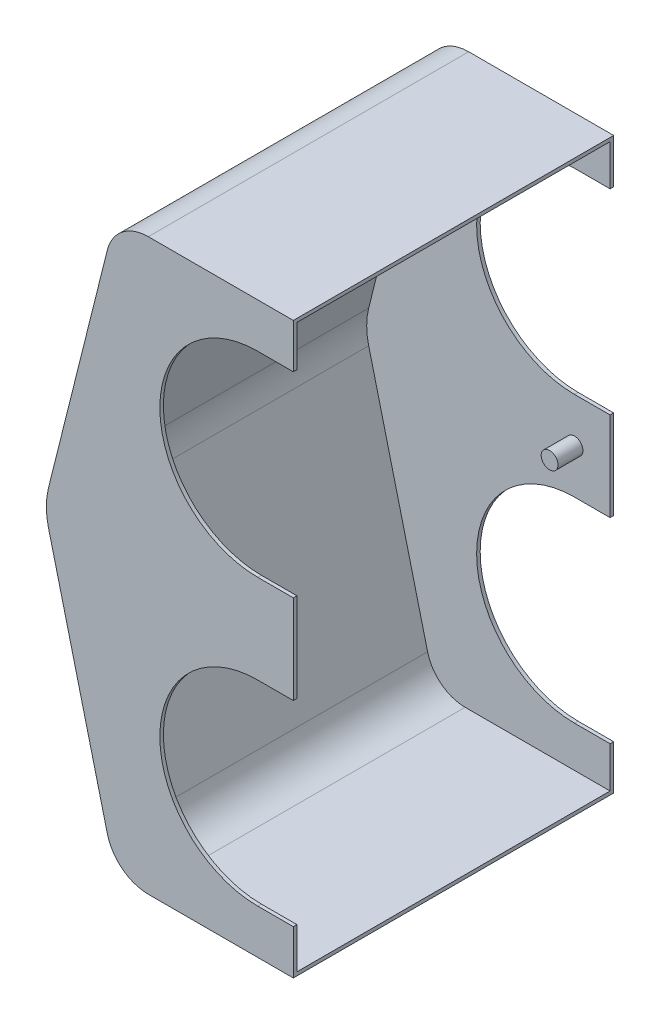
ISO-10303-21;
HEADER;
FILE_DESCRIPTION(('STEP AP214'),'2;1');
FILE_NAME('part.step','',(''),(''),'','','');
FILE_SCHEMA(('AUTOMOTIVE_DESIGN { 1 0 10303 214 1 1 1 1 }'));
ENDSEC;
DATA;
#1=APPLICATION_CONTEXT('core data for automotive mechanical design processes');
#2=APPLICATION_PROTOCOL_DEFINITION('international standard','automotive_design',2000,#1);
#3=PRODUCT_CONTEXT('',#1,'mechanical');
#4=PRODUCT('Part','Part','',(#3));
#5=PRODUCT_RELATED_PRODUCT_CATEGORY('part','',(#4));
#6=PRODUCT_DEFINITION_FORMATION('','',#4);
#7=PRODUCT_DEFINITION_CONTEXT('part definition',#1,'design');
#8=PRODUCT_DEFINITION('design','',#6,#7);
#9=PRODUCT_DEFINITION_SHAPE('','',#8);
#10=(LENGTH_UNIT() NAMED_UNIT(*) SI_UNIT(.MILLI.,.METRE.));
#11=(NAMED_UNIT(*) PLANE_ANGLE_UNIT() SI_UNIT($,.RADIAN.));
#12=(NAMED_UNIT(*) SI_UNIT($,.STERADIAN.) SOLID_ANGLE_UNIT());
#13=UNCERTAINTY_MEASURE_WITH_UNIT(LENGTH_MEASURE(1.E-05),#10,'distance_accuracy_value','');
#14=(GEOMETRIC_REPRESENTATION_CONTEXT(3) GLOBAL_UNCERTAINTY_ASSIGNED_CONTEXT((#13)) GLOBAL_UNIT_ASSIGNED_CONTEXT((#10,
#11,#12)) REPRESENTATION_CONTEXT('',''));
#15=CARTESIAN_POINT('',(0.,0.,0.));
#16=DIRECTION('',(0.,0.,1.));
#17=DIRECTION('',(1.,0.,0.));
#18=AXIS2_PLACEMENT_3D('',#15,#16,#17);
#19=CARTESIAN_POINT('',(0.,0.,0.));
#20=DIRECTION('',(1.,0.,0.));
#21=DIRECTION('',(0.,0.,-1.));
#22=AXIS2_PLACEMENT_3D('',#19,#20,#21);
#23=PLANE('',#22);
#24=DIRECTION('',(0.,-1.,0.));
#25=VECTOR('',#24,1.);
#26=CARTESIAN_POINT('',(0.,0.,-1.27));
#27=LINE('',#26,#25);
#28=CARTESIAN_POINT('',(0.,-85.725,-1.27000000000001));
#29=VERTEX_POINT('',#28);
#30=CARTESIAN_POINT('',(0.,-117.475,-1.27000000000001));
#31=VERTEX_POINT('',#30);
#32=EDGE_CURVE('E290',#29,#31,#27,.T.);
#33=ORIENTED_EDGE('',*,*,#32,.F.);
#34=DIRECTION('',(0.,0.,1.));
#35=VECTOR('',#34,1.);
#36=CARTESIAN_POINT('',(0.,-85.725,-114.3));
#37=LINE('',#36,#35);
#38=CARTESIAN_POINT('',(0.,-85.725,0.));
#39=VERTEX_POINT('',#38);
#40=EDGE_CURVE('E359',#29,#39,#37,.T.);
#41=ORIENTED_EDGE('',*,*,#40,.T.);
#42=DIRECTION('',(0.,-1.,0.));
#43=VECTOR('',#42,1.);
#44=CARTESIAN_POINT('',(0.,0.,0.));
#45=LINE('',#44,#43);
#46=CARTESIAN_POINT('',(0.,-117.475,0.));
#47=VERTEX_POINT('',#46);
#48=EDGE_CURVE('E411',#39,#47,#45,.T.);
#49=ORIENTED_EDGE('',*,*,#48,.T.);
#50=DIRECTION('',(0.,0.,1.));
#51=VECTOR('',#50,1.);
#52=CARTESIAN_POINT('',(0.,-117.475,-114.3));
#53=LINE('',#52,#51);
#54=EDGE_CURVE('E389',#31,#47,#53,.T.);
#55=ORIENTED_EDGE('',*,*,#54,.F.);
#56=EDGE_LOOP('',(#33,#41,#49,#55));
#57=FACE_BOUND('',#56,.T.);
#58=ADVANCED_FACE('F38',(#57),#23,.T.);
#59=CARTESIAN_POINT('',(-12.7,-152.4,-114.3));
#60=DIRECTION('',(0.,0.,1.));
#61=DIRECTION('',(1.,0.,0.));
#62=AXIS2_PLACEMENT_3D('',#59,#60,#61);
#63=CYLINDRICAL_SURFACE('',#62,34.925);
#64=CARTESIAN_POINT('',(-12.7,-152.4,-1.27000000000002));
#65=DIRECTION('',(0.,0.,1.));
#66=DIRECTION('',(0.,-1.,0.));
#67=AXIS2_PLACEMENT_3D('',#64,#65,#66);
#68=CIRCLE('',#67,34.925);
#69=CARTESIAN_POINT('',(-12.7,-117.475,-1.27000000000001));
#70=VERTEX_POINT('',#69);
#71=CARTESIAN_POINT('',(-12.7,-187.325,-1.27000000000002));
#72=VERTEX_POINT('',#71);
#73=EDGE_CURVE('E297',#70,#72,#68,.T.);
#74=ORIENTED_EDGE('',*,*,#73,.F.);
#75=DIRECTION('',(0.,0.,1.));
#76=VECTOR('',#75,1.);
#77=CARTESIAN_POINT('',(-12.7,-117.475,-114.3));
#78=LINE('',#77,#76);
#79=CARTESIAN_POINT('',(-12.7,-117.475,0.));
#80=VERTEX_POINT('',#79);
#81=EDGE_CURVE('E385',#70,#80,#78,.T.);
#82=ORIENTED_EDGE('',*,*,#81,.T.);
#83=CARTESIAN_POINT('',(-12.7,-152.4,0.));
#84=DIRECTION('',(0.,0.,1.));
#85=DIRECTION('',(1.,0.,0.));
#86=AXIS2_PLACEMENT_3D('',#83,#84,#85);
#87=CIRCLE('',#86,34.925);
#88=CARTESIAN_POINT('',(-12.7,-187.325,0.));
#89=VERTEX_POINT('',#88);
#90=EDGE_CURVE('E352',#80,#89,#87,.T.);
#91=ORIENTED_EDGE('',*,*,#90,.T.);
#92=DIRECTION('',(0.,0.,1.));
#93=VECTOR('',#92,1.);
#94=CARTESIAN_POINT('',(-12.7,-187.325,-114.3));
#95=LINE('',#94,#93);
#96=EDGE_CURVE('E373',#72,#89,#95,.T.);
#97=ORIENTED_EDGE('',*,*,#96,.F.);
#98=EDGE_LOOP('',(#74,#82,#91,#97));
#99=FACE_BOUND('',#98,.T.);
#100=ADVANCED_FACE('F503',(#99),#63,.F.);
#101=CARTESIAN_POINT('',(-12.7,-117.475,-114.3));
#102=DIRECTION('',(0.,1.,0.));
#103=DIRECTION('',(0.,0.,1.));
#104=AXIS2_PLACEMENT_3D('',#101,#102,#103);
#105=PLANE('',#104);
#106=DIRECTION('',(-1.,0.,0.));
#107=VECTOR('',#106,1.);
#108=CARTESIAN_POINT('',(-88.9,-117.475,-1.27000000000002));
#109=LINE('',#108,#107);
#110=EDGE_CURVE('E293',#31,#70,#109,.T.);
#111=ORIENTED_EDGE('',*,*,#110,.F.);
#112=ORIENTED_EDGE('',*,*,#54,.T.);
#113=DIRECTION('',(-1.,0.,0.));
#114=VECTOR('',#113,1.);
#115=CARTESIAN_POINT('',(-12.7,-117.475,0.));
#116=LINE('',#115,#114);
#117=EDGE_CURVE('E367',#47,#80,#116,.T.);
#118=ORIENTED_EDGE('',*,*,#117,.T.);
#119=ORIENTED_EDGE('',*,*,#81,.F.);
#120=EDGE_LOOP('',(#111,#112,#118,#119));
#121=FACE_BOUND('',#120,.T.);
#122=ADVANCED_FACE('F498',(#121),#105,.F.);
#123=CARTESIAN_POINT('',(-12.7,-187.325,-114.3));
#124=DIRECTION('',(0.,-1.,0.));
#125=DIRECTION('',(0.,0.,-1.));
#126=AXIS2_PLACEMENT_3D('',#123,#124,#125);
#127=PLANE('',#126);
#128=DIRECTION('',(1.,0.,0.));
#129=VECTOR('',#128,1.);
#130=CARTESIAN_POINT('',(-88.9,-187.325,-1.27000000000003));
#131=LINE('',#130,#129);
#132=CARTESIAN_POINT('',(0.,-187.325,-1.27000000000002));
#133=VERTEX_POINT('',#132);
#134=EDGE_CURVE('E296',#72,#133,#131,.T.);
#135=ORIENTED_EDGE('',*,*,#134,.F.);
#136=ORIENTED_EDGE('',*,*,#96,.T.);
#137=DIRECTION('',(1.,0.,0.));
#138=VECTOR('',#137,1.);
#139=CARTESIAN_POINT('',(-12.7,-187.325,0.));
#140=LINE('',#139,#138);
#141=CARTESIAN_POINT('',(0.,-187.325,0.));
#142=VERTEX_POINT('',#141);
#143=EDGE_CURVE('E376',#89,#142,#140,.T.);
#144=ORIENTED_EDGE('',*,*,#143,.T.);
#145=DIRECTION('',(0.,0.,1.));
#146=VECTOR('',#145,1.);
#147=CARTESIAN_POINT('',(0.,-187.325,-114.3));
#148=LINE('',#147,#146);
#149=EDGE_CURVE('E393',#133,#142,#148,.T.);
#150=ORIENTED_EDGE('',*,*,#149,.F.);
#151=EDGE_LOOP('',(#135,#136,#144,#150));
#152=FACE_BOUND('',#151,.T.);
#153=ADVANCED_FACE('F505',(#152),#127,.F.);
#154=CARTESIAN_POINT('',(-12.7,-50.8,-114.3));
#155=DIRECTION('',(0.,0.,1.));
#156=DIRECTION('',(1.,0.,0.));
#157=AXIS2_PLACEMENT_3D('',#154,#155,#156);
#158=CYLINDRICAL_SURFACE('',#157,34.925);
#159=CARTESIAN_POINT('',(-12.7,-50.8,-1.27000000000001));
#160=DIRECTION('',(0.,0.,1.));
#161=DIRECTION('',(0.,-1.,0.));
#162=AXIS2_PLACEMENT_3D('',#159,#160,#161);
#163=CIRCLE('',#162,34.925);
#164=CARTESIAN_POINT('',(-12.7,-15.875,-1.26999999999999));
#165=VERTEX_POINT('',#164);
#166=CARTESIAN_POINT('',(-12.7,-85.725,-1.27000000000001));
#167=VERTEX_POINT('',#166);
#168=EDGE_CURVE('E286',#165,#167,#163,.T.);
#169=ORIENTED_EDGE('',*,*,#168,.F.);
#170=DIRECTION('',(0.,0.,1.));
#171=VECTOR('',#170,1.);
#172=CARTESIAN_POINT('',(-12.7,-15.875,-114.3));
#173=LINE('',#172,#171);
#174=CARTESIAN_POINT('',(-12.7,-15.875,0.));
#175=VERTEX_POINT('',#174);
#176=EDGE_CURVE('E353',#165,#175,#173,.T.);
#177=ORIENTED_EDGE('',*,*,#176,.T.);
#178=CARTESIAN_POINT('',(-12.7,-50.8,0.));
#179=DIRECTION('',(0.,0.,1.));
#180=DIRECTION('',(1.,0.,0.));
#181=AXIS2_PLACEMENT_3D('',#178,#179,#180);
#182=CIRCLE('',#181,34.925);
#183=CARTESIAN_POINT('',(-12.7,-85.725,0.));
#184=VERTEX_POINT('',#183);
#185=EDGE_CURVE('E340',#175,#184,#182,.T.);
#186=ORIENTED_EDGE('',*,*,#185,.T.);
#187=DIRECTION('',(0.,0.,1.));
#188=VECTOR('',#187,1.);
#189=CARTESIAN_POINT('',(-12.7,-85.725,-114.3));
#190=LINE('',#189,#188);
#191=EDGE_CURVE('E339',#167,#184,#190,.T.);
#192=ORIENTED_EDGE('',*,*,#191,.F.);
#193=EDGE_LOOP('',(#169,#177,#186,#192));
#194=FACE_BOUND('',#193,.T.);
#195=ADVANCED_FACE('F618',(#194),#158,.F.);
#196=CARTESIAN_POINT('',(-12.7,-15.875,-114.3));
#197=DIRECTION('',(0.,1.,0.));
#198=DIRECTION('',(0.,0.,1.));
#199=AXIS2_PLACEMENT_3D('',#196,#197,#198);
#200=PLANE('',#199);
#201=DIRECTION('',(-1.,0.,0.));
#202=VECTOR('',#201,1.);
#203=CARTESIAN_POINT('',(-88.9,-15.875,-1.27));
#204=LINE('',#203,#202);
#205=CARTESIAN_POINT('',(0.,-15.875,-1.26999999999999));
#206=VERTEX_POINT('',#205);
#207=EDGE_CURVE('E282',#206,#165,#204,.T.);
#208=ORIENTED_EDGE('',*,*,#207,.F.);
#209=DIRECTION('',(0.,0.,1.));
#210=VECTOR('',#209,1.);
#211=CARTESIAN_POINT('',(0.,-15.875,-114.3));
#212=LINE('',#211,#210);
#213=CARTESIAN_POINT('',(0.,-15.875,0.));
#214=VERTEX_POINT('',#213);
#215=EDGE_CURVE('E357',#206,#214,#212,.T.);
#216=ORIENTED_EDGE('',*,*,#215,.T.);
#217=DIRECTION('',(-1.,0.,0.));
#218=VECTOR('',#217,1.);
#219=CARTESIAN_POINT('',(-12.7,-15.875,0.));
#220=LINE('',#219,#218);
#221=EDGE_CURVE('E334',#214,#175,#220,.T.);
#222=ORIENTED_EDGE('',*,*,#221,.T.);
#223=ORIENTED_EDGE('',*,*,#176,.F.);
#224=EDGE_LOOP('',(#208,#216,#222,#223));
#225=FACE_BOUND('',#224,.T.);
#226=ADVANCED_FACE('F612',(#225),#200,.F.);
#227=CARTESIAN_POINT('',(-12.7,-85.725,-114.3));
#228=DIRECTION('',(0.,-1.,0.));
#229=DIRECTION('',(0.,0.,-1.));
#230=AXIS2_PLACEMENT_3D('',#227,#228,#229);
#231=PLANE('',#230);
#232=DIRECTION('',(1.,0.,0.));
#233=VECTOR('',#232,1.);
#234=CARTESIAN_POINT('',(-88.9,-85.725,-1.27000000000001));
#235=LINE('',#234,#233);
#236=EDGE_CURVE('E285',#167,#29,#235,.T.);
#237=ORIENTED_EDGE('',*,*,#236,.F.);
#238=ORIENTED_EDGE('',*,*,#191,.T.);
#239=DIRECTION('',(1.,0.,0.));
#240=VECTOR('',#239,1.);
#241=CARTESIAN_POINT('',(-12.7,-85.725,0.));
#242=LINE('',#241,#240);
#243=EDGE_CURVE('E343',#184,#39,#242,.T.);
#244=ORIENTED_EDGE('',*,*,#243,.T.);
#245=ORIENTED_EDGE('',*,*,#40,.F.);
#246=EDGE_LOOP('',(#237,#238,#244,#245));
#247=FACE_BOUND('',#246,.T.);
#248=ADVANCED_FACE('F572',(#247),#231,.F.);
#249=DIRECTION('',(0.,1.,0.));
#250=VECTOR('',#249,1.);
#251=CARTESIAN_POINT('',(0.,0.,-113.03));
#252=LINE('',#251,#250);
#253=CARTESIAN_POINT('',(0.,-15.875,-113.03));
#254=VERTEX_POINT('',#253);
#255=CARTESIAN_POINT('',(0.,-1.27,-113.03));
#256=VERTEX_POINT('',#255);
#257=EDGE_CURVE('E305',#254,#256,#252,.T.);
#258=ORIENTED_EDGE('',*,*,#257,.F.);
#259=CARTESIAN_POINT('',(0.,-15.875,-114.3));
#260=VERTEX_POINT('',#259);
#261=EDGE_CURVE('E354',#260,#254,#212,.T.);
#262=ORIENTED_EDGE('',*,*,#261,.F.);
#263=DIRECTION('',(0.,1.,0.));
#264=VECTOR('',#263,1.);
#265=CARTESIAN_POINT('',(0.,0.,-114.3));
#266=LINE('',#265,#264);
#267=CARTESIAN_POINT('',(0.,0.,-114.3));
#268=VERTEX_POINT('',#267);
#269=EDGE_CURVE('E414',#260,#268,#266,.T.);
#270=ORIENTED_EDGE('',*,*,#269,.T.);
#271=DIRECTION('',(0.,0.,1.));
#272=VECTOR('',#271,1.);
#273=CARTESIAN_POINT('',(0.,0.,0.));
#274=LINE('',#273,#272);
#275=CARTESIAN_POINT('',(0.,0.,0.));
#276=VERTEX_POINT('',#275);
#277=EDGE_CURVE('E418',#268,#276,#274,.T.);
#278=ORIENTED_EDGE('',*,*,#277,.T.);
#279=EDGE_CURVE('E407',#276,#214,#45,.T.);
#280=ORIENTED_EDGE('',*,*,#279,.T.);
#281=ORIENTED_EDGE('',*,*,#215,.F.);
#282=DIRECTION('',(0.,-1.,0.));
#283=VECTOR('',#282,1.);
#284=CARTESIAN_POINT('',(0.,0.,-1.27));
#285=LINE('',#284,#283);
#286=CARTESIAN_POINT('',(0.,-1.27,-1.27));
#287=VERTEX_POINT('',#286);
#288=EDGE_CURVE('E292',#287,#206,#285,.T.);
#289=ORIENTED_EDGE('',*,*,#288,.F.);
#290=DIRECTION('',(0.,0.,1.));
#291=VECTOR('',#290,1.);
#292=CARTESIAN_POINT('',(0.,-1.27,0.));
#293=LINE('',#292,#291);
#294=EDGE_CURVE('E308',#256,#287,#293,.T.);
#295=ORIENTED_EDGE('',*,*,#294,.F.);
#296=EDGE_LOOP('',(#258,#262,#270,#278,#280,#281,#289,#295));
#297=FACE_BOUND('',#296,.T.);
#298=ADVANCED_FACE('F562',(#297),#23,.T.);
#299=DIRECTION('',(0.,1.,0.));
#300=VECTOR('',#299,1.);
#301=CARTESIAN_POINT('',(0.,0.,-113.03));
#302=LINE('',#301,#300);
#303=CARTESIAN_POINT('',(0.,-117.475,-113.03));
#304=VERTEX_POINT('',#303);
#305=CARTESIAN_POINT('',(0.,-85.725,-113.03));
#306=VERTEX_POINT('',#305);
#307=EDGE_CURVE('E53',#304,#306,#302,.T.);
#308=ORIENTED_EDGE('',*,*,#307,.F.);
#309=CARTESIAN_POINT('',(0.,-117.475,-114.3));
#310=VERTEX_POINT('',#309);
#311=EDGE_CURVE('E386',#310,#304,#53,.T.);
#312=ORIENTED_EDGE('',*,*,#311,.F.);
#313=CARTESIAN_POINT('',(0.,-85.725,-114.3));
#314=VERTEX_POINT('',#313);
#315=EDGE_CURVE('E419',#310,#314,#266,.T.);
#316=ORIENTED_EDGE('',*,*,#315,.T.);
#317=EDGE_CURVE('E60',#314,#306,#37,.T.);
#318=ORIENTED_EDGE('',*,*,#317,.T.);
#319=EDGE_LOOP('',(#308,#312,#316,#318));
#320=FACE_BOUND('',#319,.T.);
#321=ADVANCED_FACE('F571',(#320),#23,.T.);
#322=CARTESIAN_POINT('',(-88.9,0.,0.));
#323=DIRECTION('',(0.,0.,1.));
#324=DIRECTION('',(0.,-1.,0.));
#325=AXIS2_PLACEMENT_3D('',#322,#323,#324);
#326=PLANE('',#325);
#327=ORIENTED_EDGE('',*,*,#221,.F.);
#328=ORIENTED_EDGE('',*,*,#279,.F.);
#329=DIRECTION('',(1.,0.,0.));
#330=VECTOR('',#329,1.);
#331=CARTESIAN_POINT('',(-88.9,0.,0.));
#332=LINE('',#331,#330);
#333=CARTESIAN_POINT('',(-51.7258917914214,0.,0.));
#334=VERTEX_POINT('',#333);
#335=EDGE_CURVE('E423',#334,#276,#332,.T.);
#336=ORIENTED_EDGE('',*,*,#335,.F.);
#337=CARTESIAN_POINT('',(-51.7258917914214,-15.08,0.));
#338=DIRECTION('',(0.,0.,1.));
#339=DIRECTION('',(0.,-1.,0.));
#340=AXIS2_PLACEMENT_3D('',#337,#338,#339);
#341=CIRCLE('',#340,15.08);
#342=CARTESIAN_POINT('',(-66.355640693613,-11.4225627744521,0.));
#343=VERTEX_POINT('',#342);
#344=EDGE_CURVE('E454',#334,#343,#341,.T.);
#345=ORIENTED_EDGE('',*,*,#344,.T.);
#346=DIRECTION('',(-0.242535625036333,-0.970142500145332,0.));
#347=VECTOR('',#346,1.);
#348=CARTESIAN_POINT('',(-59.7647058823529,14.9411764705882,0.));
#349=LINE('',#348,#347);
#350=CARTESIAN_POINT('',(-87.3696002060207,-95.4784008240831,0.));
#351=VERTEX_POINT('',#350);
#352=EDGE_CURVE('E403',#343,#351,#349,.T.);
#353=ORIENTED_EDGE('',*,*,#352,.T.);
#354=CARTESIAN_POINT('',(-62.8832035023526,-101.6,0.));
#355=DIRECTION('',(0.,0.,1.));
#356=DIRECTION('',(0.,-1.,0.));
#357=AXIS2_PLACEMENT_3D('',#354,#355,#356);
#358=CIRCLE('',#357,25.24);
#359=CARTESIAN_POINT('',(-87.3696002060207,-107.721599175917,0.));
#360=VERTEX_POINT('',#359);
#361=EDGE_CURVE('E441',#351,#360,#358,.T.);
#362=ORIENTED_EDGE('',*,*,#361,.T.);
#363=DIRECTION('',(0.242535625036333,-0.970142500145332,0.));
#364=VECTOR('',#363,1.);
#365=CARTESIAN_POINT('',(-107.576470588235,-26.8941176470588,0.));
#366=LINE('',#365,#364);
#367=CARTESIAN_POINT('',(-66.355640693613,-191.777437225548,0.));
#368=VERTEX_POINT('',#367);
#369=EDGE_CURVE('E397',#360,#368,#366,.T.);
#370=ORIENTED_EDGE('',*,*,#369,.T.);
#371=CARTESIAN_POINT('',(-51.7258917914214,-188.12,0.));
#372=DIRECTION('',(0.,0.,1.));
#373=DIRECTION('',(0.,-1.,0.));
#374=AXIS2_PLACEMENT_3D('',#371,#372,#373);
#375=CIRCLE('',#374,15.08);
#376=CARTESIAN_POINT('',(-51.7258917914214,-203.2,0.));
#377=VERTEX_POINT('',#376);
#378=EDGE_CURVE('E452',#368,#377,#375,.T.);
#379=ORIENTED_EDGE('',*,*,#378,.T.);
#380=DIRECTION('',(1.,0.,0.));
#381=VECTOR('',#380,1.);
#382=CARTESIAN_POINT('',(-88.9,-203.2,0.));
#383=LINE('',#382,#381);
#384=CARTESIAN_POINT('',(0.,-203.2,0.));
#385=VERTEX_POINT('',#384);
#386=EDGE_CURVE('E422',#377,#385,#383,.T.);
#387=ORIENTED_EDGE('',*,*,#386,.T.);
#388=EDGE_CURVE('E405',#142,#385,#45,.T.);
#389=ORIENTED_EDGE('',*,*,#388,.F.);
#390=ORIENTED_EDGE('',*,*,#143,.F.);
#391=ORIENTED_EDGE('',*,*,#90,.F.);
#392=ORIENTED_EDGE('',*,*,#117,.F.);
#393=ORIENTED_EDGE('',*,*,#48,.F.);
#394=ORIENTED_EDGE('',*,*,#243,.F.);
#395=ORIENTED_EDGE('',*,*,#185,.F.);
#396=EDGE_LOOP('',(#327,#328,#336,#345,#353,#362,#370,#379,#387,#389,#390,#391,#392,#393,#394,#395));
#397=FACE_BOUND('',#396,.T.);
#398=ADVANCED_FACE('F468',(#397),#326,.T.);
#399=CARTESIAN_POINT('',(-88.9,0.,0.));
#400=DIRECTION('',(0.,1.,0.));
#401=DIRECTION('',(0.,0.,1.));
#402=AXIS2_PLACEMENT_3D('',#399,#400,#401);
#403=PLANE('',#402);
#404=DIRECTION('',(1.,0.,0.));
#405=VECTOR('',#404,1.);
#406=CARTESIAN_POINT('',(-88.9,0.,-114.3));
#407=LINE('',#406,#405);
#408=CARTESIAN_POINT('',(-51.7258917914214,0.,-114.3));
#409=VERTEX_POINT('',#408);
#410=EDGE_CURVE('E426',#409,#268,#407,.T.);
#411=ORIENTED_EDGE('',*,*,#410,.F.);
#412=DIRECTION('',(0.,0.,-1.));
#413=VECTOR('',#412,1.);
#414=CARTESIAN_POINT('',(-51.7258917914214,0.,0.));
#415=LINE('',#414,#413);
#416=EDGE_CURVE('E450',#409,#334,#415,.F.);
#417=ORIENTED_EDGE('',*,*,#416,.T.);
#418=ORIENTED_EDGE('',*,*,#335,.T.);
#419=ORIENTED_EDGE('',*,*,#277,.F.);
#420=EDGE_LOOP('',(#411,#417,#418,#419));
#421=FACE_BOUND('',#420,.T.);
#422=ADVANCED_FACE('F587',(#421),#403,.T.);
#423=CARTESIAN_POINT('',(-88.9,0.,-114.3));
#424=DIRECTION('',(0.,0.,-1.));
#425=DIRECTION('',(0.,1.,0.));
#426=AXIS2_PLACEMENT_3D('',#423,#424,#425);
#427=PLANE('',#426);
#428=DIRECTION('',(-1.,0.,0.));
#429=VECTOR('',#428,1.);
#430=CARTESIAN_POINT('',(-12.7,-15.875,-114.3));
#431=LINE('',#430,#429);
#432=CARTESIAN_POINT('',(-12.7,-15.875,-114.3));
#433=VERTEX_POINT('',#432);
#434=EDGE_CURVE('E336',#260,#433,#431,.T.);
#435=ORIENTED_EDGE('',*,*,#434,.T.);
#436=CARTESIAN_POINT('',(-12.7,-50.8,-114.3));
#437=DIRECTION('',(0.,0.,1.));
#438=DIRECTION('',(1.,0.,0.));
#439=AXIS2_PLACEMENT_3D('',#436,#437,#438);
#440=CIRCLE('',#439,34.925);
#441=CARTESIAN_POINT('',(-12.7,-85.725,-114.3));
#442=VERTEX_POINT('',#441);
#443=EDGE_CURVE('E330',#433,#442,#440,.T.);
#444=ORIENTED_EDGE('',*,*,#443,.T.);
#445=DIRECTION('',(1.,0.,0.));
#446=VECTOR('',#445,1.);
#447=CARTESIAN_POINT('',(-12.7,-85.725,-114.3));
#448=LINE('',#447,#446);
#449=EDGE_CURVE('E333',#442,#314,#448,.T.);
#450=ORIENTED_EDGE('',*,*,#449,.T.);
#451=ORIENTED_EDGE('',*,*,#315,.F.);
#452=DIRECTION('',(-1.,0.,0.));
#453=VECTOR('',#452,1.);
#454=CARTESIAN_POINT('',(-12.7,-117.475,-114.3));
#455=LINE('',#454,#453);
#456=CARTESIAN_POINT('',(-12.7,-117.475,-114.3));
#457=VERTEX_POINT('',#456);
#458=EDGE_CURVE('E370',#310,#457,#455,.T.);
#459=ORIENTED_EDGE('',*,*,#458,.T.);
#460=CARTESIAN_POINT('',(-12.7,-152.4,-114.3));
#461=DIRECTION('',(0.,0.,1.));
#462=DIRECTION('',(1.,0.,0.));
#463=AXIS2_PLACEMENT_3D('',#460,#461,#462);
#464=CIRCLE('',#463,34.925);
#465=CARTESIAN_POINT('',(-12.7,-187.325,-114.3));
#466=VERTEX_POINT('',#465);
#467=EDGE_CURVE('E363',#457,#466,#464,.T.);
#468=ORIENTED_EDGE('',*,*,#467,.T.);
#469=DIRECTION('',(1.,0.,0.));
#470=VECTOR('',#469,1.);
#471=CARTESIAN_POINT('',(-12.7,-187.325,-114.3));
#472=LINE('',#471,#470);
#473=CARTESIAN_POINT('',(0.,-187.325,-114.3));
#474=VERTEX_POINT('',#473);
#475=EDGE_CURVE('E366',#466,#474,#472,.T.);
#476=ORIENTED_EDGE('',*,*,#475,.T.);
#477=CARTESIAN_POINT('',(0.,-203.2,-114.3));
#478=VERTEX_POINT('',#477);
#479=EDGE_CURVE('E415',#478,#474,#266,.T.);
#480=ORIENTED_EDGE('',*,*,#479,.F.);
#481=DIRECTION('',(1.,0.,0.));
#482=VECTOR('',#481,1.);
#483=CARTESIAN_POINT('',(-88.9,-203.2,-114.3));
#484=LINE('',#483,#482);
#485=CARTESIAN_POINT('',(-51.7258917914214,-203.2,-114.3));
#486=VERTEX_POINT('',#485);
#487=EDGE_CURVE('E429',#486,#478,#484,.T.);
#488=ORIENTED_EDGE('',*,*,#487,.F.);
#489=CARTESIAN_POINT('',(-51.7258917914214,-188.12,-114.3));
#490=DIRECTION('',(0.,0.,-1.));
#491=DIRECTION('',(0.,1.,0.));
#492=AXIS2_PLACEMENT_3D('',#489,#490,#491);
#493=CIRCLE('',#492,15.08);
#494=CARTESIAN_POINT('',(-66.355640693613,-191.777437225548,-114.3));
#495=VERTEX_POINT('',#494);
#496=EDGE_CURVE('E446',#486,#495,#493,.T.);
#497=ORIENTED_EDGE('',*,*,#496,.T.);
#498=DIRECTION('',(0.242535625036333,-0.970142500145332,0.));
#499=VECTOR('',#498,1.);
#500=CARTESIAN_POINT('',(-107.576470588235,-26.8941176470588,-114.3));
#501=LINE('',#500,#499);
#502=CARTESIAN_POINT('',(-87.3696002060207,-107.721599175917,-114.3));
#503=VERTEX_POINT('',#502);
#504=EDGE_CURVE('E384',#503,#495,#501,.T.);
#505=ORIENTED_EDGE('',*,*,#504,.F.);
#506=CARTESIAN_POINT('',(-62.8832035023526,-101.6,-114.3));
#507=DIRECTION('',(0.,0.,-1.));
#508=DIRECTION('',(0.,1.,0.));
#509=AXIS2_PLACEMENT_3D('',#506,#507,#508);
#510=CIRCLE('',#509,25.24);
#511=CARTESIAN_POINT('',(-87.3696002060207,-95.478400824083,-114.3));
#512=VERTEX_POINT('',#511);
#513=EDGE_CURVE('E435',#503,#512,#510,.T.);
#514=ORIENTED_EDGE('',*,*,#513,.T.);
#515=DIRECTION('',(-0.242535625036333,-0.970142500145332,0.));
#516=VECTOR('',#515,1.);
#517=CARTESIAN_POINT('',(-59.7647058823529,14.9411764705882,-114.3));
#518=LINE('',#517,#516);
#519=CARTESIAN_POINT('',(-66.355640693613,-11.4225627744521,-114.3));
#520=VERTEX_POINT('',#519);
#521=EDGE_CURVE('E400',#520,#512,#518,.T.);
#522=ORIENTED_EDGE('',*,*,#521,.F.);
#523=CARTESIAN_POINT('',(-51.7258917914214,-15.08,-114.3));
#524=DIRECTION('',(0.,0.,-1.));
#525=DIRECTION('',(0.,1.,0.));
#526=AXIS2_PLACEMENT_3D('',#523,#524,#525);
#527=CIRCLE('',#526,15.08);
#528=EDGE_CURVE('E448',#520,#409,#527,.T.);
#529=ORIENTED_EDGE('',*,*,#528,.T.);
#530=ORIENTED_EDGE('',*,*,#410,.T.);
#531=ORIENTED_EDGE('',*,*,#269,.F.);
#532=EDGE_LOOP('',(#435,#444,#450,#451,#459,#468,#476,#480,#488,#497,#505,#514,#522,#529,#530,#531));
#533=FACE_BOUND('',#532,.T.);
#534=ADVANCED_FACE('F478',(#533),#427,.T.);
#535=CARTESIAN_POINT('',(-88.9,-203.2,0.));
#536=DIRECTION('',(0.,-1.,0.));
#537=DIRECTION('',(0.,0.,-1.));
#538=AXIS2_PLACEMENT_3D('',#535,#536,#537);
#539=PLANE('',#538);
#540=ORIENTED_EDGE('',*,*,#386,.F.);
#541=DIRECTION('',(0.,0.,-1.));
#542=VECTOR('',#541,1.);
#543=CARTESIAN_POINT('',(-51.7258917914214,-203.2,-114.3));
#544=LINE('',#543,#542);
#545=EDGE_CURVE('E456',#377,#486,#544,.T.);
#546=ORIENTED_EDGE('',*,*,#545,.T.);
#547=ORIENTED_EDGE('',*,*,#487,.T.);
#548=DIRECTION('',(0.,0.,-1.));
#549=VECTOR('',#548,1.);
#550=CARTESIAN_POINT('',(0.,-203.2,0.));
#551=LINE('',#550,#549);
#552=EDGE_CURVE('E410',#385,#478,#551,.T.);
#553=ORIENTED_EDGE('',*,*,#552,.F.);
#554=EDGE_LOOP('',(#540,#546,#547,#553));
#555=FACE_BOUND('',#554,.T.);
#556=ADVANCED_FACE('F474',(#555),#539,.T.);
#557=DIRECTION('',(0.,-1.,0.));
#558=VECTOR('',#557,1.);
#559=CARTESIAN_POINT('',(0.,0.,-1.27));
#560=LINE('',#559,#558);
#561=CARTESIAN_POINT('',(0.,-201.93,-1.27000000000003));
#562=VERTEX_POINT('',#561);
#563=EDGE_CURVE('E269',#133,#562,#560,.T.);
#564=ORIENTED_EDGE('',*,*,#563,.F.);
#565=ORIENTED_EDGE('',*,*,#149,.T.);
#566=ORIENTED_EDGE('',*,*,#388,.T.);
#567=ORIENTED_EDGE('',*,*,#552,.T.);
#568=ORIENTED_EDGE('',*,*,#479,.T.);
#569=CARTESIAN_POINT('',(0.,-187.325,-113.03));
#570=VERTEX_POINT('',#569);
#571=EDGE_CURVE('E390',#474,#570,#148,.T.);
#572=ORIENTED_EDGE('',*,*,#571,.T.);
#573=DIRECTION('',(0.,1.,0.));
#574=VECTOR('',#573,1.);
#575=CARTESIAN_POINT('',(0.,0.,-113.03));
#576=LINE('',#575,#574);
#577=CARTESIAN_POINT('',(0.,-201.93,-113.03));
#578=VERTEX_POINT('',#577);
#579=EDGE_CURVE('E306',#578,#570,#576,.T.);
#580=ORIENTED_EDGE('',*,*,#579,.F.);
#581=DIRECTION('',(0.,0.,-1.));
#582=VECTOR('',#581,1.);
#583=CARTESIAN_POINT('',(0.,-201.93,0.));
#584=LINE('',#583,#582);
#585=EDGE_CURVE('E302',#562,#578,#584,.T.);
#586=ORIENTED_EDGE('',*,*,#585,.F.);
#587=EDGE_LOOP('',(#564,#565,#566,#567,#568,#572,#580,#586));
#588=FACE_BOUND('',#587,.T.);
#589=ADVANCED_FACE('F482',(#588),#23,.T.);
#590=CARTESIAN_POINT('',(-59.7647058823529,14.9411764705882,0.));
#591=DIRECTION('',(0.970142500145332,-0.242535625036333,0.));
#592=DIRECTION('',(0.242535625036333,0.970142500145332,0.));
#593=AXIS2_PLACEMENT_3D('',#590,#591,#592);
#594=PLANE('',#593);
#595=ORIENTED_EDGE('',*,*,#352,.F.);
#596=DIRECTION('',(0.,0.,-1.));
#597=VECTOR('',#596,1.);
#598=CARTESIAN_POINT('',(-66.355640693613,-11.4225627744521,-114.3));
#599=LINE('',#598,#597);
#600=EDGE_CURVE('E443',#343,#520,#599,.T.);
#601=ORIENTED_EDGE('',*,*,#600,.T.);
#602=ORIENTED_EDGE('',*,*,#521,.T.);
#603=DIRECTION('',(0.,0.,-1.));
#604=VECTOR('',#603,1.);
#605=CARTESIAN_POINT('',(-87.3696002060207,-95.478400824083,0.));
#606=LINE('',#605,#604);
#607=EDGE_CURVE('E438',#512,#351,#606,.F.);
#608=ORIENTED_EDGE('',*,*,#607,.T.);
#609=EDGE_LOOP('',(#595,#601,#602,#608));
#610=FACE_BOUND('',#609,.T.);
#611=ADVANCED_FACE('F575',(#610),#594,.F.);
#612=CARTESIAN_POINT('',(-107.576470588235,-26.8941176470588,0.));
#613=DIRECTION('',(0.970142500145332,0.242535625036333,0.));
#614=DIRECTION('',(-0.242535625036333,0.970142500145332,0.));
#615=AXIS2_PLACEMENT_3D('',#612,#613,#614);
#616=PLANE('',#615);
#617=ORIENTED_EDGE('',*,*,#504,.T.);
#618=DIRECTION('',(0.,0.,-1.));
#619=VECTOR('',#618,1.);
#620=CARTESIAN_POINT('',(-66.355640693613,-191.777437225548,0.));
#621=LINE('',#620,#619);
#622=EDGE_CURVE('E46',#495,#368,#621,.F.);
#623=ORIENTED_EDGE('',*,*,#622,.T.);
#624=ORIENTED_EDGE('',*,*,#369,.F.);
#625=DIRECTION('',(0.,0.,-1.));
#626=VECTOR('',#625,1.);
#627=CARTESIAN_POINT('',(-87.3696002060207,-107.721599175917,0.));
#628=LINE('',#627,#626);
#629=EDGE_CURVE('E425',#360,#503,#628,.T.);
#630=ORIENTED_EDGE('',*,*,#629,.T.);
#631=EDGE_LOOP('',(#617,#623,#624,#630));
#632=FACE_BOUND('',#631,.T.);
#633=ADVANCED_FACE('F461',(#632),#616,.F.);
#634=CARTESIAN_POINT('',(-62.8832035023526,-101.6,0.));
#635=DIRECTION('',(0.,0.,-1.));
#636=DIRECTION('',(0.,1.,0.));
#637=AXIS2_PLACEMENT_3D('',#634,#635,#636);
#638=CYLINDRICAL_SURFACE('',#637,25.24);
#639=ORIENTED_EDGE('',*,*,#361,.F.);
#640=ORIENTED_EDGE('',*,*,#607,.F.);
#641=ORIENTED_EDGE('',*,*,#513,.F.);
#642=ORIENTED_EDGE('',*,*,#629,.F.);
#643=EDGE_LOOP('',(#639,#640,#641,#642));
#644=FACE_BOUND('',#643,.T.);
#645=ADVANCED_FACE('F887',(#644),#638,.T.);
#646=CARTESIAN_POINT('',(-51.7258917914214,-15.08,0.));
#647=DIRECTION('',(0.,0.,1.));
#648=DIRECTION('',(1.,0.,0.));
#649=AXIS2_PLACEMENT_3D('',#646,#647,#648);
#650=CYLINDRICAL_SURFACE('',#649,15.08);
#651=ORIENTED_EDGE('',*,*,#344,.F.);
#652=ORIENTED_EDGE('',*,*,#416,.F.);
#653=ORIENTED_EDGE('',*,*,#528,.F.);
#654=ORIENTED_EDGE('',*,*,#600,.F.);
#655=EDGE_LOOP('',(#651,#652,#653,#654));
#656=FACE_BOUND('',#655,.T.);
#657=ADVANCED_FACE('F879',(#656),#650,.T.);
#658=CARTESIAN_POINT('',(-51.7258917914214,-188.12,0.));
#659=DIRECTION('',(0.,0.,1.));
#660=DIRECTION('',(1.,0.,0.));
#661=AXIS2_PLACEMENT_3D('',#658,#659,#660);
#662=CYLINDRICAL_SURFACE('',#661,15.08);
#663=ORIENTED_EDGE('',*,*,#378,.F.);
#664=ORIENTED_EDGE('',*,*,#622,.F.);
#665=ORIENTED_EDGE('',*,*,#496,.F.);
#666=ORIENTED_EDGE('',*,*,#545,.F.);
#667=EDGE_LOOP('',(#663,#664,#665,#666));
#668=FACE_BOUND('',#667,.T.);
#669=ADVANCED_FACE('F40',(#668),#662,.T.);
#670=CARTESIAN_POINT('',(-12.7,-117.475,-113.03));
#671=VERTEX_POINT('',#670);
#672=EDGE_CURVE('E381',#457,#671,#78,.T.);
#673=ORIENTED_EDGE('',*,*,#672,.T.);
#674=CARTESIAN_POINT('',(-12.7,-152.4,-113.03));
#675=DIRECTION('',(0.,0.,-1.));
#676=DIRECTION('',(0.,1.,0.));
#677=AXIS2_PLACEMENT_3D('',#674,#675,#676);
#678=CIRCLE('',#677,34.925);
#679=CARTESIAN_POINT('',(-12.7,-187.325,-113.03));
#680=VERTEX_POINT('',#679);
#681=EDGE_CURVE('E295',#671,#680,#678,.F.);
#682=ORIENTED_EDGE('',*,*,#681,.T.);
#683=EDGE_CURVE('E394',#466,#680,#95,.T.);
#684=ORIENTED_EDGE('',*,*,#683,.F.);
#685=ORIENTED_EDGE('',*,*,#467,.F.);
#686=EDGE_LOOP('',(#673,#682,#684,#685));
#687=FACE_BOUND('',#686,.T.);
#688=ADVANCED_FACE('F567',(#687),#63,.F.);
#689=ORIENTED_EDGE('',*,*,#311,.T.);
#690=DIRECTION('',(-1.,0.,0.));
#691=VECTOR('',#690,1.);
#692=CARTESIAN_POINT('',(-12.7,-117.475,-113.03));
#693=LINE('',#692,#691);
#694=EDGE_CURVE('E312',#304,#671,#693,.T.);
#695=ORIENTED_EDGE('',*,*,#694,.T.);
#696=ORIENTED_EDGE('',*,*,#672,.F.);
#697=ORIENTED_EDGE('',*,*,#458,.F.);
#698=EDGE_LOOP('',(#689,#695,#696,#697));
#699=FACE_BOUND('',#698,.T.);
#700=ADVANCED_FACE('F593',(#699),#105,.F.);
#701=ORIENTED_EDGE('',*,*,#683,.T.);
#702=DIRECTION('',(1.,0.,0.));
#703=VECTOR('',#702,1.);
#704=CARTESIAN_POINT('',(-12.7,-187.325,-113.03));
#705=LINE('',#704,#703);
#706=EDGE_CURVE('E309',#680,#570,#705,.T.);
#707=ORIENTED_EDGE('',*,*,#706,.T.);
#708=ORIENTED_EDGE('',*,*,#571,.F.);
#709=ORIENTED_EDGE('',*,*,#475,.F.);
#710=EDGE_LOOP('',(#701,#707,#708,#709));
#711=FACE_BOUND('',#710,.T.);
#712=ADVANCED_FACE('F778',(#711),#127,.F.);
#713=CARTESIAN_POINT('',(-12.7,-15.875,-113.03));
#714=VERTEX_POINT('',#713);
#715=EDGE_CURVE('E349',#433,#714,#173,.T.);
#716=ORIENTED_EDGE('',*,*,#715,.T.);
#717=CARTESIAN_POINT('',(-12.7,-50.8,-113.03));
#718=DIRECTION('',(0.,0.,-1.));
#719=DIRECTION('',(0.,1.,0.));
#720=AXIS2_PLACEMENT_3D('',#717,#718,#719);
#721=CIRCLE('',#720,34.925);
#722=CARTESIAN_POINT('',(-12.7,-85.725,-113.03));
#723=VERTEX_POINT('',#722);
#724=EDGE_CURVE('E284',#714,#723,#721,.F.);
#725=ORIENTED_EDGE('',*,*,#724,.T.);
#726=EDGE_CURVE('E360',#442,#723,#190,.T.);
#727=ORIENTED_EDGE('',*,*,#726,.F.);
#728=ORIENTED_EDGE('',*,*,#443,.F.);
#729=EDGE_LOOP('',(#716,#725,#727,#728));
#730=FACE_BOUND('',#729,.T.);
#731=ADVANCED_FACE('F637',(#730),#158,.F.);
#732=ORIENTED_EDGE('',*,*,#261,.T.);
#733=DIRECTION('',(-1.,0.,0.));
#734=VECTOR('',#733,1.);
#735=CARTESIAN_POINT('',(-12.7,-15.875,-113.03));
#736=LINE('',#735,#734);
#737=EDGE_CURVE('E299',#254,#714,#736,.T.);
#738=ORIENTED_EDGE('',*,*,#737,.T.);
#739=ORIENTED_EDGE('',*,*,#715,.F.);
#740=ORIENTED_EDGE('',*,*,#434,.F.);
#741=EDGE_LOOP('',(#732,#738,#739,#740));
#742=FACE_BOUND('',#741,.T.);
#743=ADVANCED_FACE('F627',(#742),#200,.F.);
#744=ORIENTED_EDGE('',*,*,#726,.T.);
#745=DIRECTION('',(1.,0.,0.));
#746=VECTOR('',#745,1.);
#747=CARTESIAN_POINT('',(-12.7,-85.725,-113.03));
#748=LINE('',#747,#746);
#749=EDGE_CURVE('E319',#723,#306,#748,.T.);
#750=ORIENTED_EDGE('',*,*,#749,.T.);
#751=ORIENTED_EDGE('',*,*,#317,.F.);
#752=ORIENTED_EDGE('',*,*,#449,.F.);
#753=EDGE_LOOP('',(#744,#750,#751,#752));
#754=FACE_BOUND('',#753,.T.);
#755=ADVANCED_FACE('F622',(#754),#231,.F.);
#756=CARTESIAN_POINT('',(-88.9,0.,-1.27));
#757=DIRECTION('',(0.,0.,1.));
#758=DIRECTION('',(0.,-1.,0.));
#759=AXIS2_PLACEMENT_3D('',#756,#757,#758);
#760=PLANE('',#759);
#761=CARTESIAN_POINT('',(-12.7,-101.6,-1.26999999999998));
#762=DIRECTION('',(0.,0.,1.));
#763=DIRECTION('',(1.,0.,0.));
#764=AXIS2_PLACEMENT_3D('',#761,#762,#763);
#765=CIRCLE('',#764,3.);
#766=CARTESIAN_POINT('',(-9.7,-101.6,-1.26999999999998));
#767=VERTEX_POINT('',#766);
#768=EDGE_CURVE('E742',#767,#767,#765,.T.);
#769=ORIENTED_EDGE('',*,*,#768,.T.);
#770=EDGE_LOOP('',(#769));
#771=FACE_BOUND('',#770,.T.);
#772=ORIENTED_EDGE('',*,*,#207,.T.);
#773=ORIENTED_EDGE('',*,*,#168,.T.);
#774=ORIENTED_EDGE('',*,*,#236,.T.);
#775=ORIENTED_EDGE('',*,*,#32,.T.);
#776=ORIENTED_EDGE('',*,*,#110,.T.);
#777=ORIENTED_EDGE('',*,*,#73,.T.);
#778=ORIENTED_EDGE('',*,*,#134,.T.);
#779=ORIENTED_EDGE('',*,*,#563,.T.);
#780=DIRECTION('',(1.,0.,0.));
#781=VECTOR('',#780,1.);
#782=CARTESIAN_POINT('',(-88.9,-201.93,-1.27000000000003));
#783=LINE('',#782,#781);
#784=CARTESIAN_POINT('',(-51.7258917914214,-201.93,-1.27000000000003));
#785=VERTEX_POINT('',#784);
#786=EDGE_CURVE('E328',#785,#562,#783,.T.);
#787=ORIENTED_EDGE('',*,*,#786,.F.);
#788=CARTESIAN_POINT('',(-51.7258917914214,-188.12,-1.27000000000003));
#789=DIRECTION('',(0.,0.,1.));
#790=DIRECTION('',(0.,-1.,0.));
#791=AXIS2_PLACEMENT_3D('',#788,#789,#790);
#792=CIRCLE('',#791,13.81);
#793=CARTESIAN_POINT('',(-65.1235597184285,-191.469416981752,-1.27000000000003));
#794=VERTEX_POINT('',#793);
#795=EDGE_CURVE('E259',#794,#785,#792,.T.);
#796=ORIENTED_EDGE('',*,*,#795,.F.);
#797=DIRECTION('',(0.242535625036333,-0.970142500145332,0.));
#798=VECTOR('',#797,1.);
#799=CARTESIAN_POINT('',(-106.344389613051,-26.5860974032627,-1.27));
#800=LINE('',#799,#798);
#801=CARTESIAN_POINT('',(-86.1375192308362,-107.413578932121,-1.27000000000002));
#802=VERTEX_POINT('',#801);
#803=EDGE_CURVE('E529',#802,#794,#800,.T.);
#804=ORIENTED_EDGE('',*,*,#803,.F.);
#805=CARTESIAN_POINT('',(-62.8832035023526,-101.6,-1.27000000000002));
#806=DIRECTION('',(0.,0.,1.));
#807=DIRECTION('',(0.,-1.,0.));
#808=AXIS2_PLACEMENT_3D('',#805,#806,#807);
#809=CIRCLE('',#808,23.97);
#810=CARTESIAN_POINT('',(-86.1375192308362,-95.7864210678792,-1.27000000000002));
#811=VERTEX_POINT('',#810);
#812=EDGE_CURVE('E265',#811,#802,#809,.T.);
#813=ORIENTED_EDGE('',*,*,#812,.F.);
#814=DIRECTION('',(-0.242535625036333,-0.970142500145332,0.));
#815=VECTOR('',#814,1.);
#816=CARTESIAN_POINT('',(-58.5326249071684,14.6331562267921,-1.27));
#817=LINE('',#816,#815);
#818=CARTESIAN_POINT('',(-65.1235597184285,-11.7305830182482,-1.27));
#819=VERTEX_POINT('',#818);
#820=EDGE_CURVE('E262',#819,#811,#817,.T.);
#821=ORIENTED_EDGE('',*,*,#820,.F.);
#822=CARTESIAN_POINT('',(-51.7258917914214,-15.08,-1.27));
#823=DIRECTION('',(0.,0.,1.));
#824=DIRECTION('',(0.,-1.,0.));
#825=AXIS2_PLACEMENT_3D('',#822,#823,#824);
#826=CIRCLE('',#825,13.81);
#827=CARTESIAN_POINT('',(-51.7258917914214,-1.27,-1.27));
#828=VERTEX_POINT('',#827);
#829=EDGE_CURVE('E248',#828,#819,#826,.T.);
#830=ORIENTED_EDGE('',*,*,#829,.F.);
#831=DIRECTION('',(1.,0.,0.));
#832=VECTOR('',#831,1.);
#833=CARTESIAN_POINT('',(-88.9,-1.27,-1.27));
#834=LINE('',#833,#832);
#835=EDGE_CURVE('E525',#828,#287,#834,.T.);
#836=ORIENTED_EDGE('',*,*,#835,.T.);
#837=ORIENTED_EDGE('',*,*,#288,.T.);
#838=EDGE_LOOP('',(#772,#773,#774,#775,#776,#777,#778,#779,#787,#796,#804,#813,#821,#830,#836,#837));
#839=FACE_BOUND('',#838,.T.);
#840=ADVANCED_FACE('F263',(#771,#839),#760,.F.);
#841=CARTESIAN_POINT('',(-88.9,-1.27,0.));
#842=DIRECTION('',(0.,1.,0.));
#843=DIRECTION('',(0.,0.,1.));
#844=AXIS2_PLACEMENT_3D('',#841,#842,#843);
#845=PLANE('',#844);
#846=DIRECTION('',(1.,0.,0.));
#847=VECTOR('',#846,1.);
#848=CARTESIAN_POINT('',(-88.9,-1.27,-113.03));
#849=LINE('',#848,#847);
#850=CARTESIAN_POINT('',(-51.7258917914214,-1.27,-113.03));
#851=VERTEX_POINT('',#850);
#852=EDGE_CURVE('E518',#851,#256,#849,.T.);
#853=ORIENTED_EDGE('',*,*,#852,.T.);
#854=ORIENTED_EDGE('',*,*,#294,.T.);
#855=ORIENTED_EDGE('',*,*,#835,.F.);
#856=DIRECTION('',(0.,0.,1.));
#857=VECTOR('',#856,1.);
#858=CARTESIAN_POINT('',(-51.7258917914214,-1.27,0.));
#859=LINE('',#858,#857);
#860=EDGE_CURVE('E255',#851,#828,#859,.T.);
#861=ORIENTED_EDGE('',*,*,#860,.F.);
#862=EDGE_LOOP('',(#853,#854,#855,#861));
#863=FACE_BOUND('',#862,.T.);
#864=ADVANCED_FACE('F634',(#863),#845,.F.);
#865=CARTESIAN_POINT('',(-88.9,0.,-113.03));
#866=DIRECTION('',(0.,0.,-1.));
#867=DIRECTION('',(0.,1.,0.));
#868=AXIS2_PLACEMENT_3D('',#865,#866,#867);
#869=PLANE('',#868);
#870=CARTESIAN_POINT('',(-12.7,-101.6,-113.03));
#871=DIRECTION('',(0.,0.,-1.));
#872=DIRECTION('',(0.,1.,0.));
#873=AXIS2_PLACEMENT_3D('',#870,#871,#872);
#874=CIRCLE('',#873,3.);
#875=CARTESIAN_POINT('',(-12.7,-98.6,-113.03));
#876=VERTEX_POINT('',#875);
#877=EDGE_CURVE('E12',#876,#876,#874,.F.);
#878=ORIENTED_EDGE('',*,*,#877,.F.);
#879=EDGE_LOOP('',(#878));
#880=FACE_BOUND('',#879,.T.);
#881=ORIENTED_EDGE('',*,*,#737,.F.);
#882=ORIENTED_EDGE('',*,*,#257,.T.);
#883=ORIENTED_EDGE('',*,*,#852,.F.);
#884=CARTESIAN_POINT('',(-51.7258917914214,-15.08,-113.03));
#885=DIRECTION('',(0.,0.,-1.));
#886=DIRECTION('',(0.,1.,0.));
#887=AXIS2_PLACEMENT_3D('',#884,#885,#886);
#888=CIRCLE('',#887,13.81);
#889=CARTESIAN_POINT('',(-65.1235597184285,-11.7305830182482,-113.03));
#890=VERTEX_POINT('',#889);
#891=EDGE_CURVE('E275',#890,#851,#888,.T.);
#892=ORIENTED_EDGE('',*,*,#891,.F.);
#893=DIRECTION('',(-0.242535625036333,-0.970142500145332,0.));
#894=VECTOR('',#893,1.);
#895=CARTESIAN_POINT('',(-63.7620366718743,-6.28449083203143,-113.03));
#896=LINE('',#895,#894);
#897=CARTESIAN_POINT('',(-86.1375192308362,-95.7864210678792,-113.03));
#898=VERTEX_POINT('',#897);
#899=EDGE_CURVE('E270',#890,#898,#896,.T.);
#900=ORIENTED_EDGE('',*,*,#899,.T.);
#901=CARTESIAN_POINT('',(-62.8832035023526,-101.6,-113.03));
#902=DIRECTION('',(0.,0.,-1.));
#903=DIRECTION('',(0.,1.,0.));
#904=AXIS2_PLACEMENT_3D('',#901,#902,#903);
#905=CIRCLE('',#904,23.97);
#906=CARTESIAN_POINT('',(-86.1375192308362,-107.413578932121,-113.03));
#907=VERTEX_POINT('',#906);
#908=EDGE_CURVE('E530',#907,#898,#905,.T.);
#909=ORIENTED_EDGE('',*,*,#908,.F.);
#910=DIRECTION('',(0.242535625036333,-0.970142500145332,0.));
#911=VECTOR('',#910,1.);
#912=CARTESIAN_POINT('',(-111.573801377757,-5.66845034443915,-113.03));
#913=LINE('',#912,#911);
#914=CARTESIAN_POINT('',(-65.1235597184285,-191.469416981752,-113.03));
#915=VERTEX_POINT('',#914);
#916=EDGE_CURVE('E317',#907,#915,#913,.T.);
#917=ORIENTED_EDGE('',*,*,#916,.T.);
#918=CARTESIAN_POINT('',(-51.7258917914214,-188.12,-113.03));
#919=DIRECTION('',(0.,0.,-1.));
#920=DIRECTION('',(0.,1.,0.));
#921=AXIS2_PLACEMENT_3D('',#918,#919,#920);
#922=CIRCLE('',#921,13.81);
#923=CARTESIAN_POINT('',(-51.7258917914214,-201.93,-113.03));
#924=VERTEX_POINT('',#923);
#925=EDGE_CURVE('E273',#924,#915,#922,.T.);
#926=ORIENTED_EDGE('',*,*,#925,.F.);
#927=DIRECTION('',(1.,0.,0.));
#928=VECTOR('',#927,1.);
#929=CARTESIAN_POINT('',(-88.9,-201.93,-113.03));
#930=LINE('',#929,#928);
#931=EDGE_CURVE('E514',#924,#578,#930,.T.);
#932=ORIENTED_EDGE('',*,*,#931,.T.);
#933=ORIENTED_EDGE('',*,*,#579,.T.);
#934=ORIENTED_EDGE('',*,*,#706,.F.);
#935=ORIENTED_EDGE('',*,*,#681,.F.);
#936=ORIENTED_EDGE('',*,*,#694,.F.);
#937=ORIENTED_EDGE('',*,*,#307,.T.);
#938=ORIENTED_EDGE('',*,*,#749,.F.);
#939=ORIENTED_EDGE('',*,*,#724,.F.);
#940=EDGE_LOOP('',(#881,#882,#883,#892,#900,#909,#917,#926,#932,#933,#934,#935,#936,#937,#938,#939));
#941=FACE_BOUND('',#940,.T.);
#942=ADVANCED_FACE('F550',(#880,#941),#869,.F.);
#943=CARTESIAN_POINT('',(-88.9,-201.93,0.));
#944=DIRECTION('',(0.,-1.,0.));
#945=DIRECTION('',(0.,0.,-1.));
#946=AXIS2_PLACEMENT_3D('',#943,#944,#945);
#947=PLANE('',#946);
#948=ORIENTED_EDGE('',*,*,#786,.T.);
#949=ORIENTED_EDGE('',*,*,#585,.T.);
#950=ORIENTED_EDGE('',*,*,#931,.F.);
#951=DIRECTION('',(0.,0.,-1.));
#952=VECTOR('',#951,1.);
#953=CARTESIAN_POINT('',(-51.7258917914214,-201.93,0.));
#954=LINE('',#953,#952);
#955=EDGE_CURVE('E258',#785,#924,#954,.T.);
#956=ORIENTED_EDGE('',*,*,#955,.F.);
#957=EDGE_LOOP('',(#948,#949,#950,#956));
#958=FACE_BOUND('',#957,.T.);
#959=ADVANCED_FACE('F512',(#958),#947,.F.);
#960=CARTESIAN_POINT('',(-58.5326249071684,14.6331562267921,0.));
#961=DIRECTION('',(0.970142500145332,-0.242535625036333,0.));
#962=DIRECTION('',(0.242535625036333,0.970142500145332,0.));
#963=AXIS2_PLACEMENT_3D('',#960,#961,#962);
#964=PLANE('',#963);
#965=ORIENTED_EDGE('',*,*,#820,.T.);
#966=DIRECTION('',(0.,0.,1.));
#967=VECTOR('',#966,1.);
#968=CARTESIAN_POINT('',(-86.1375192308362,-95.7864210678792,0.));
#969=LINE('',#968,#967);
#970=EDGE_CURVE('E277',#898,#811,#969,.T.);
#971=ORIENTED_EDGE('',*,*,#970,.F.);
#972=ORIENTED_EDGE('',*,*,#899,.F.);
#973=DIRECTION('',(0.,0.,1.));
#974=VECTOR('',#973,1.);
#975=CARTESIAN_POINT('',(-65.1235597184285,-11.7305830182482,0.));
#976=LINE('',#975,#974);
#977=EDGE_CURVE('E252',#819,#890,#976,.F.);
#978=ORIENTED_EDGE('',*,*,#977,.F.);
#979=EDGE_LOOP('',(#965,#971,#972,#978));
#980=FACE_BOUND('',#979,.T.);
#981=ADVANCED_FACE('F272',(#980),#964,.T.);
#982=CARTESIAN_POINT('',(-106.344389613051,-26.5860974032627,0.));
#983=DIRECTION('',(0.970142500145332,0.242535625036333,0.));
#984=DIRECTION('',(-0.242535625036333,0.970142500145332,0.));
#985=AXIS2_PLACEMENT_3D('',#982,#983,#984);
#986=PLANE('',#985);
#987=ORIENTED_EDGE('',*,*,#916,.F.);
#988=DIRECTION('',(0.,0.,1.));
#989=VECTOR('',#988,1.);
#990=CARTESIAN_POINT('',(-86.1375192308362,-107.413578932121,0.));
#991=LINE('',#990,#989);
#992=EDGE_CURVE('E533',#802,#907,#991,.F.);
#993=ORIENTED_EDGE('',*,*,#992,.F.);
#994=ORIENTED_EDGE('',*,*,#803,.T.);
#995=DIRECTION('',(0.,0.,1.));
#996=VECTOR('',#995,1.);
#997=CARTESIAN_POINT('',(-65.1235597184285,-191.469416981752,0.));
#998=LINE('',#997,#996);
#999=EDGE_CURVE('E344',#915,#794,#998,.T.);
#1000=ORIENTED_EDGE('',*,*,#999,.F.);
#1001=EDGE_LOOP('',(#987,#993,#994,#1000));
#1002=FACE_BOUND('',#1001,.T.);
#1003=ADVANCED_FACE('F547',(#1002),#986,.T.);
#1004=CARTESIAN_POINT('',(-62.8832035023526,-101.6,0.));
#1005=DIRECTION('',(0.,0.,-1.));
#1006=DIRECTION('',(0.,1.,0.));
#1007=AXIS2_PLACEMENT_3D('',#1004,#1005,#1006);
#1008=CYLINDRICAL_SURFACE('',#1007,23.97);
#1009=ORIENTED_EDGE('',*,*,#812,.T.);
#1010=ORIENTED_EDGE('',*,*,#992,.T.);
#1011=ORIENTED_EDGE('',*,*,#908,.T.);
#1012=ORIENTED_EDGE('',*,*,#970,.T.);
#1013=EDGE_LOOP('',(#1009,#1010,#1011,#1012));
#1014=FACE_BOUND('',#1013,.T.);
#1015=ADVANCED_FACE('F551',(#1014),#1008,.F.);
#1016=CARTESIAN_POINT('',(-51.7258917914214,-15.08,0.));
#1017=DIRECTION('',(0.,0.,1.));
#1018=DIRECTION('',(1.,0.,0.));
#1019=AXIS2_PLACEMENT_3D('',#1016,#1017,#1018);
#1020=CYLINDRICAL_SURFACE('',#1019,13.81);
#1021=ORIENTED_EDGE('',*,*,#829,.T.);
#1022=ORIENTED_EDGE('',*,*,#977,.T.);
#1023=ORIENTED_EDGE('',*,*,#891,.T.);
#1024=ORIENTED_EDGE('',*,*,#860,.T.);
#1025=EDGE_LOOP('',(#1021,#1022,#1023,#1024));
#1026=FACE_BOUND('',#1025,.T.);
#1027=ADVANCED_FACE('F250',(#1026),#1020,.F.);
#1028=CARTESIAN_POINT('',(-51.7258917914214,-188.12,0.));
#1029=DIRECTION('',(0.,0.,1.));
#1030=DIRECTION('',(1.,0.,0.));
#1031=AXIS2_PLACEMENT_3D('',#1028,#1029,#1030);
#1032=CYLINDRICAL_SURFACE('',#1031,13.81);
#1033=ORIENTED_EDGE('',*,*,#795,.T.);
#1034=ORIENTED_EDGE('',*,*,#955,.T.);
#1035=ORIENTED_EDGE('',*,*,#925,.T.);
#1036=ORIENTED_EDGE('',*,*,#999,.T.);
#1037=EDGE_LOOP('',(#1033,#1034,#1035,#1036));
#1038=FACE_BOUND('',#1037,.T.);
#1039=ADVANCED_FACE('F549',(#1038),#1032,.F.);
#1040=CARTESIAN_POINT('',(-12.7,-101.6,-104.14));
#1041=DIRECTION('',(0.,0.,-1.));
#1042=DIRECTION('',(-1.,0.,0.));
#1043=AXIS2_PLACEMENT_3D('',#1040,#1041,#1042);
#1044=CYLINDRICAL_SURFACE('',#1043,3.);
#1045=CARTESIAN_POINT('',(-12.7,-101.6,-104.14));
#1046=DIRECTION('',(0.,0.,1.));
#1047=DIRECTION('',(1.,0.,0.));
#1048=AXIS2_PLACEMENT_3D('',#1045,#1046,#1047);
#1049=CIRCLE('',#1048,3.);
#1050=CARTESIAN_POINT('',(-9.7,-101.6,-104.14));
#1051=VERTEX_POINT('',#1050);
#1052=EDGE_CURVE('E288',#1051,#1051,#1049,.T.);
#1053=ORIENTED_EDGE('',*,*,#1052,.F.);
#1054=EDGE_LOOP('',(#1053));
#1055=FACE_BOUND('',#1054,.T.);
#1056=ORIENTED_EDGE('',*,*,#877,.T.);
#1057=EDGE_LOOP('',(#1056));
#1058=FACE_BOUND('',#1057,.T.);
#1059=ADVANCED_FACE('F682',(#1055,#1058),#1044,.T.);
#1060=CARTESIAN_POINT('',(-12.7,-101.6,-104.14));
#1061=DIRECTION('',(0.,0.,1.));
#1062=DIRECTION('',(1.,0.,0.));
#1063=AXIS2_PLACEMENT_3D('',#1060,#1061,#1062);
#1064=PLANE('',#1063);
#1065=ORIENTED_EDGE('',*,*,#1052,.T.);
#1066=EDGE_LOOP('',(#1065));
#1067=FACE_BOUND('',#1066,.T.);
#1068=ADVANCED_FACE('F699',(#1067),#1064,.T.);
#1069=CARTESIAN_POINT('',(-12.7,-101.6,-10.16));
#1070=DIRECTION('',(0.,0.,1.));
#1071=DIRECTION('',(1.,0.,0.));
#1072=AXIS2_PLACEMENT_3D('',#1069,#1070,#1071);
#1073=CYLINDRICAL_SURFACE('',#1072,3.);
#1074=CARTESIAN_POINT('',(-12.7,-101.6,-10.16));
#1075=DIRECTION('',(0.,0.,1.));
#1076=DIRECTION('',(1.,0.,0.));
#1077=AXIS2_PLACEMENT_3D('',#1074,#1075,#1076);
#1078=CIRCLE('',#1077,3.);
#1079=CARTESIAN_POINT('',(-9.7,-101.6,-10.16));
#1080=VERTEX_POINT('',#1079);
#1081=EDGE_CURVE('E741',#1080,#1080,#1078,.T.);
#1082=ORIENTED_EDGE('',*,*,#1081,.T.);
#1083=EDGE_LOOP('',(#1082));
#1084=FACE_BOUND('',#1083,.T.);
#1085=ORIENTED_EDGE('',*,*,#768,.F.);
#1086=EDGE_LOOP('',(#1085));
#1087=FACE_BOUND('',#1086,.T.);
#1088=ADVANCED_FACE('F708',(#1084,#1087),#1073,.T.);
#1089=CARTESIAN_POINT('',(-12.7,-101.6,-10.16));
#1090=DIRECTION('',(0.,0.,-1.));
#1091=DIRECTION('',(1.,0.,0.));
#1092=AXIS2_PLACEMENT_3D('',#1089,#1090,#1091);
#1093=PLANE('',#1092);
#1094=ORIENTED_EDGE('',*,*,#1081,.F.);
#1095=EDGE_LOOP('',(#1094));
#1096=FACE_BOUND('',#1095,.T.);
#1097=ADVANCED_FACE('F725',(#1096),#1093,.T.);
#1098=CLOSED_SHELL('',(#58,#100,#122,#153,#195,#226,#248,#298,#321,#398,#422,#534,#556,#589,
#611,#633,#645,#657,#669,#688,#700,#712,#731,#743,#755,#840,#864,#942,#959,#981,#1003,#1015,
#1027,#1039,#1059,#1068,#1088,#1097));
#1099=MANIFOLD_SOLID_BREP('B2',#1098);
#1100=ADVANCED_BREP_SHAPE_REPRESENTATION('',(#18,#1099),#14);
#1101=SHAPE_DEFINITION_REPRESENTATION(#9,#1100);
ENDSEC;
END-ISO-10303-21;
